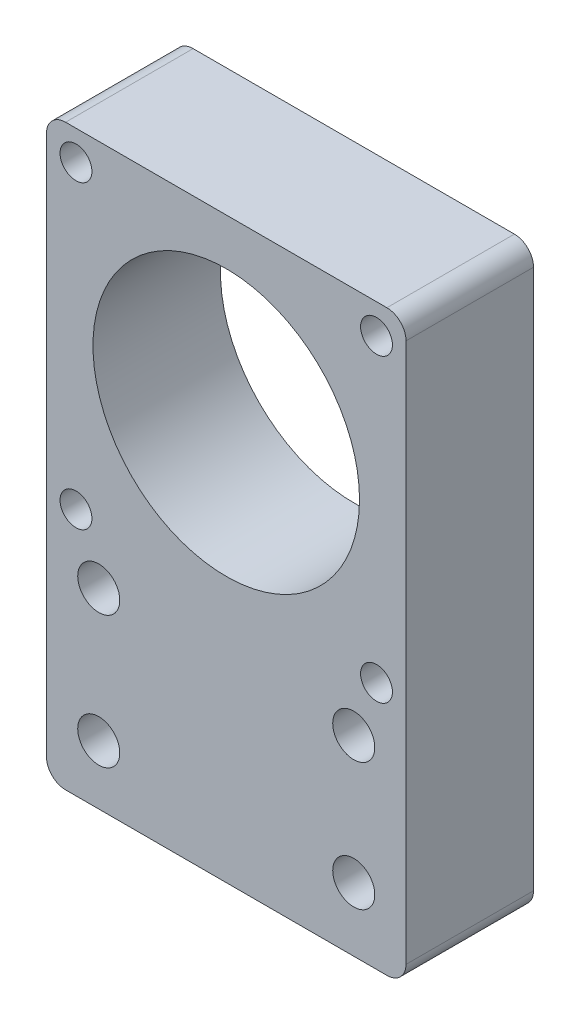
ISO-10303-21;
HEADER;
FILE_DESCRIPTION(('STEP AP214'),'2;1');
FILE_NAME('part.step','',(''),(''),'','','');
FILE_SCHEMA(('AUTOMOTIVE_DESIGN { 1 0 10303 214 1 1 1 1 }'));
ENDSEC;
DATA;
#1=APPLICATION_CONTEXT('core data for automotive mechanical design processes');
#2=APPLICATION_PROTOCOL_DEFINITION('international standard','automotive_design',2000,#1);
#3=PRODUCT_CONTEXT('',#1,'mechanical');
#4=PRODUCT('Part','Part','',(#3));
#5=PRODUCT_RELATED_PRODUCT_CATEGORY('part','',(#4));
#6=PRODUCT_DEFINITION_FORMATION('','',#4);
#7=PRODUCT_DEFINITION_CONTEXT('part definition',#1,'design');
#8=PRODUCT_DEFINITION('design','',#6,#7);
#9=PRODUCT_DEFINITION_SHAPE('','',#8);
#10=(LENGTH_UNIT() NAMED_UNIT(*) SI_UNIT(.MILLI.,.METRE.));
#11=(NAMED_UNIT(*) PLANE_ANGLE_UNIT() SI_UNIT($,.RADIAN.));
#12=(NAMED_UNIT(*) SI_UNIT($,.STERADIAN.) SOLID_ANGLE_UNIT());
#13=UNCERTAINTY_MEASURE_WITH_UNIT(LENGTH_MEASURE(1.E-05),#10,'distance_accuracy_value','');
#14=(GEOMETRIC_REPRESENTATION_CONTEXT(3) GLOBAL_UNCERTAINTY_ASSIGNED_CONTEXT((#13)) GLOBAL_UNIT_ASSIGNED_CONTEXT((#10,
#11,#12)) REPRESENTATION_CONTEXT('',''));
#15=CARTESIAN_POINT('',(0.,0.,0.));
#16=DIRECTION('',(0.,0.,1.));
#17=DIRECTION('',(1.,0.,0.));
#18=AXIS2_PLACEMENT_3D('',#15,#16,#17);
#19=CARTESIAN_POINT('',(-28.2000000001139,53.2000000000001,20.));
#20=DIRECTION('',(0.,-1.,0.));
#21=DIRECTION('',(0.,0.,-1.));
#22=AXIS2_PLACEMENT_3D('',#19,#20,#21);
#23=PLANE('',#22);
#24=DIRECTION('',(-1.,0.,0.));
#25=VECTOR('',#24,1.);
#26=CARTESIAN_POINT('',(-28.2000000001139,53.2000000000001,20.));
#27=LINE('',#26,#25);
#28=CARTESIAN_POINT('',(25.1999999998861,53.2000000000001,20.));
#29=VERTEX_POINT('',#28);
#30=CARTESIAN_POINT('',(-25.2000000001139,53.2000000000001,20.));
#31=VERTEX_POINT('',#30);
#32=EDGE_CURVE('E138',#29,#31,#27,.T.);
#33=ORIENTED_EDGE('',*,*,#32,.F.);
#34=DIRECTION('',(0.,0.,-1.));
#35=VECTOR('',#34,1.);
#36=CARTESIAN_POINT('',(25.1999999998861,53.2000000000001,20.));
#37=LINE('',#36,#35);
#38=CARTESIAN_POINT('',(25.1999999998861,53.2000000000001,0.));
#39=VERTEX_POINT('',#38);
#40=EDGE_CURVE('E13',#29,#39,#37,.T.);
#41=ORIENTED_EDGE('',*,*,#40,.T.);
#42=DIRECTION('',(-1.,0.,0.));
#43=VECTOR('',#42,1.);
#44=CARTESIAN_POINT('',(-28.2000000001139,53.2000000000001,0.));
#45=LINE('',#44,#43);
#46=CARTESIAN_POINT('',(-25.2000000001139,53.2000000000001,0.));
#47=VERTEX_POINT('',#46);
#48=EDGE_CURVE('E143',#39,#47,#45,.T.);
#49=ORIENTED_EDGE('',*,*,#48,.T.);
#50=DIRECTION('',(0.,0.,-1.));
#51=VECTOR('',#50,1.);
#52=CARTESIAN_POINT('',(-25.2000000001139,53.2000000000001,20.));
#53=LINE('',#52,#51);
#54=EDGE_CURVE('E52',#47,#31,#53,.F.);
#55=ORIENTED_EDGE('',*,*,#54,.T.);
#56=EDGE_LOOP('',(#33,#41,#49,#55));
#57=FACE_BOUND('',#56,.T.);
#58=ADVANCED_FACE('F44',(#57),#23,.F.);
#59=CARTESIAN_POINT('',(-28.2000000001139,-3.19999999999987,20.));
#60=DIRECTION('',(1.,0.,0.));
#61=DIRECTION('',(0.,1.,0.));
#62=AXIS2_PLACEMENT_3D('',#59,#60,#61);
#63=PLANE('',#62);
#64=DIRECTION('',(0.,-1.,0.));
#65=VECTOR('',#64,1.);
#66=CARTESIAN_POINT('',(-28.2000000001139,-3.19999999999987,0.));
#67=LINE('',#66,#65);
#68=CARTESIAN_POINT('',(-28.2000000001139,50.2000000000001,0.));
#69=VERTEX_POINT('',#68);
#70=CARTESIAN_POINT('',(-28.2000000001139,-34.4999999999999,0.));
#71=VERTEX_POINT('',#70);
#72=EDGE_CURVE('E139',#69,#71,#67,.T.);
#73=ORIENTED_EDGE('',*,*,#72,.T.);
#74=DIRECTION('',(0.,0.,-1.));
#75=VECTOR('',#74,1.);
#76=CARTESIAN_POINT('',(-28.2000000001139,-34.4999999999999,20.));
#77=LINE('',#76,#75);
#78=CARTESIAN_POINT('',(-28.2000000001139,-34.4999999999999,20.));
#79=VERTEX_POINT('',#78);
#80=EDGE_CURVE('E59',#71,#79,#77,.F.);
#81=ORIENTED_EDGE('',*,*,#80,.T.);
#82=DIRECTION('',(0.,-1.,0.));
#83=VECTOR('',#82,1.);
#84=CARTESIAN_POINT('',(-28.2000000001139,-3.19999999999987,20.));
#85=LINE('',#84,#83);
#86=CARTESIAN_POINT('',(-28.2000000001139,50.2000000000001,20.));
#87=VERTEX_POINT('',#86);
#88=EDGE_CURVE('E141',#87,#79,#85,.T.);
#89=ORIENTED_EDGE('',*,*,#88,.F.);
#90=DIRECTION('',(0.,0.,-1.));
#91=VECTOR('',#90,1.);
#92=CARTESIAN_POINT('',(-28.2000000001139,50.2000000000001,20.));
#93=LINE('',#92,#91);
#94=EDGE_CURVE('E161',#87,#69,#93,.T.);
#95=ORIENTED_EDGE('',*,*,#94,.T.);
#96=EDGE_LOOP('',(#73,#81,#89,#95));
#97=FACE_BOUND('',#96,.T.);
#98=ADVANCED_FACE('F175',(#97),#63,.F.);
#99=CARTESIAN_POINT('',(28.1999999998861,53.2000000000001,20.));
#100=DIRECTION('',(-1.,0.,0.));
#101=DIRECTION('',(0.,-1.,0.));
#102=AXIS2_PLACEMENT_3D('',#99,#100,#101);
#103=PLANE('',#102);
#104=DIRECTION('',(0.,1.,0.));
#105=VECTOR('',#104,1.);
#106=CARTESIAN_POINT('',(28.1999999998861,53.2000000000001,20.));
#107=LINE('',#106,#105);
#108=CARTESIAN_POINT('',(28.1999999998861,-34.4999999999999,20.));
#109=VERTEX_POINT('',#108);
#110=CARTESIAN_POINT('',(28.1999999998861,50.2000000000001,20.));
#111=VERTEX_POINT('',#110);
#112=EDGE_CURVE('E131',#109,#111,#107,.T.);
#113=ORIENTED_EDGE('',*,*,#112,.F.);
#114=DIRECTION('',(0.,0.,-1.));
#115=VECTOR('',#114,1.);
#116=CARTESIAN_POINT('',(28.1999999998861,-34.4999999999999,0.));
#117=LINE('',#116,#115);
#118=CARTESIAN_POINT('',(28.1999999998861,-34.4999999999999,0.));
#119=VERTEX_POINT('',#118);
#120=EDGE_CURVE('E115',#109,#119,#117,.T.);
#121=ORIENTED_EDGE('',*,*,#120,.T.);
#122=DIRECTION('',(0.,1.,0.));
#123=VECTOR('',#122,1.);
#124=CARTESIAN_POINT('',(28.1999999998861,53.2000000000001,0.));
#125=LINE('',#124,#123);
#126=CARTESIAN_POINT('',(28.1999999998861,50.2000000000001,0.));
#127=VERTEX_POINT('',#126);
#128=EDGE_CURVE('E128',#119,#127,#125,.T.);
#129=ORIENTED_EDGE('',*,*,#128,.T.);
#130=DIRECTION('',(0.,0.,-1.));
#131=VECTOR('',#130,1.);
#132=CARTESIAN_POINT('',(28.1999999998861,50.2000000000001,20.));
#133=LINE('',#132,#131);
#134=EDGE_CURVE('E133',#127,#111,#133,.F.);
#135=ORIENTED_EDGE('',*,*,#134,.T.);
#136=EDGE_LOOP('',(#113,#121,#129,#135));
#137=FACE_BOUND('',#136,.T.);
#138=ADVANCED_FACE('F127',(#137),#103,.F.);
#139=CARTESIAN_POINT('',(0.,0.,20.));
#140=DIRECTION('',(0.,0.,-1.));
#141=DIRECTION('',(-1.,0.,0.));
#142=AXIS2_PLACEMENT_3D('',#139,#140,#141);
#143=PLANE('',#142);
#144=CARTESIAN_POINT('',(19.9999999998865,-7.49999999999986,20.));
#145=DIRECTION('',(0.,0.,-1.));
#146=DIRECTION('',(-1.,0.,0.));
#147=AXIS2_PLACEMENT_3D('',#144,#145,#146);
#148=CIRCLE('',#147,3.29999999999999);
#149=CARTESIAN_POINT('',(16.6999999998865,-7.49999999999986,20.));
#150=VERTEX_POINT('',#149);
#151=EDGE_CURVE('E395',#150,#150,#148,.T.);
#152=ORIENTED_EDGE('',*,*,#151,.T.);
#153=EDGE_LOOP('',(#152));
#154=FACE_BOUND('',#153,.T.);
#155=CARTESIAN_POINT('',(19.9999999998865,-27.4999999999999,20.));
#156=DIRECTION('',(0.,0.,-1.));
#157=DIRECTION('',(-1.,0.,0.));
#158=AXIS2_PLACEMENT_3D('',#155,#156,#157);
#159=CIRCLE('',#158,3.29999999999999);
#160=CARTESIAN_POINT('',(16.6999999998865,-27.4999999999999,20.));
#161=VERTEX_POINT('',#160);
#162=EDGE_CURVE('E389',#161,#161,#159,.T.);
#163=ORIENTED_EDGE('',*,*,#162,.T.);
#164=EDGE_LOOP('',(#163));
#165=FACE_BOUND('',#164,.T.);
#166=CARTESIAN_POINT('',(-20.0000000001135,-28.2376577347049,20.));
#167=DIRECTION('',(0.,0.,-1.));
#168=DIRECTION('',(-1.,0.,0.));
#169=AXIS2_PLACEMENT_3D('',#166,#167,#168);
#170=CIRCLE('',#169,3.29999999999999);
#171=CARTESIAN_POINT('',(-23.3000000001135,-28.2376577347049,20.));
#172=VERTEX_POINT('',#171);
#173=EDGE_CURVE('E383',#172,#172,#170,.T.);
#174=ORIENTED_EDGE('',*,*,#173,.T.);
#175=EDGE_LOOP('',(#174));
#176=FACE_BOUND('',#175,.T.);
#177=CARTESIAN_POINT('',(-20.0000000001135,-7.49999999999986,20.));
#178=DIRECTION('',(0.,0.,-1.));
#179=DIRECTION('',(-1.,0.,0.));
#180=AXIS2_PLACEMENT_3D('',#177,#178,#179);
#181=CIRCLE('',#180,3.29999999999999);
#182=CARTESIAN_POINT('',(-23.3000000001135,-7.49999999999986,20.));
#183=VERTEX_POINT('',#182);
#184=EDGE_CURVE('E377',#183,#183,#181,.T.);
#185=ORIENTED_EDGE('',*,*,#184,.T.);
#186=EDGE_LOOP('',(#185));
#187=FACE_BOUND('',#186,.T.);
#188=CARTESIAN_POINT('',(23.5699999998861,48.5700000000001,20.));
#189=DIRECTION('',(0.,0.,-1.));
#190=DIRECTION('',(-1.,0.,0.));
#191=AXIS2_PLACEMENT_3D('',#188,#189,#190);
#192=CIRCLE('',#191,2.5);
#193=CARTESIAN_POINT('',(21.0699999998861,48.5700000000001,20.));
#194=VERTEX_POINT('',#193);
#195=EDGE_CURVE('E371',#194,#194,#192,.T.);
#196=ORIENTED_EDGE('',*,*,#195,.T.);
#197=EDGE_LOOP('',(#196));
#198=FACE_BOUND('',#197,.T.);
#199=CARTESIAN_POINT('',(-23.5700000001139,48.5700000000001,20.));
#200=DIRECTION('',(0.,0.,-1.));
#201=DIRECTION('',(-1.,0.,0.));
#202=AXIS2_PLACEMENT_3D('',#199,#200,#201);
#203=CIRCLE('',#202,2.5);
#204=CARTESIAN_POINT('',(-26.0700000001139,48.5700000000001,20.));
#205=VERTEX_POINT('',#204);
#206=EDGE_CURVE('E349',#205,#205,#203,.T.);
#207=ORIENTED_EDGE('',*,*,#206,.T.);
#208=EDGE_LOOP('',(#207));
#209=FACE_BOUND('',#208,.T.);
#210=CARTESIAN_POINT('',(23.5699999998861,1.43000000000014,20.));
#211=DIRECTION('',(0.,0.,-1.));
#212=DIRECTION('',(-1.,0.,0.));
#213=AXIS2_PLACEMENT_3D('',#210,#211,#212);
#214=CIRCLE('',#213,2.5);
#215=CARTESIAN_POINT('',(21.0699999998861,1.43000000000014,20.));
#216=VERTEX_POINT('',#215);
#217=EDGE_CURVE('E344',#216,#216,#214,.T.);
#218=ORIENTED_EDGE('',*,*,#217,.T.);
#219=EDGE_LOOP('',(#218));
#220=FACE_BOUND('',#219,.T.);
#221=CARTESIAN_POINT('',(-23.5700000001139,1.43000000000014,20.));
#222=DIRECTION('',(0.,0.,-1.));
#223=DIRECTION('',(-1.,0.,0.));
#224=AXIS2_PLACEMENT_3D('',#221,#222,#223);
#225=CIRCLE('',#224,2.5);
#226=CARTESIAN_POINT('',(-26.0700000001139,1.43000000000014,20.));
#227=VERTEX_POINT('',#226);
#228=EDGE_CURVE('E190',#227,#227,#225,.T.);
#229=ORIENTED_EDGE('',*,*,#228,.T.);
#230=EDGE_LOOP('',(#229));
#231=FACE_BOUND('',#230,.T.);
#232=CARTESIAN_POINT('',(-1.13805060393229E-10,25.0000000000021,20.));
#233=DIRECTION('',(0.,0.,1.));
#234=DIRECTION('',(1.,0.,0.));
#235=AXIS2_PLACEMENT_3D('',#232,#233,#234);
#236=CIRCLE('',#235,20.9043555487387);
#237=CARTESIAN_POINT('',(20.9043555486249,25.0000000000021,20.));
#238=VERTEX_POINT('',#237);
#239=EDGE_CURVE('E185',#238,#238,#236,.T.);
#240=ORIENTED_EDGE('',*,*,#239,.F.);
#241=EDGE_LOOP('',(#240));
#242=FACE_BOUND('',#241,.T.);
#243=DIRECTION('',(-1.,0.,0.));
#244=VECTOR('',#243,1.);
#245=CARTESIAN_POINT('',(28.1999999998861,-37.4999999999999,20.));
#246=LINE('',#245,#244);
#247=CARTESIAN_POINT('',(25.1999999998861,-37.4999999999999,20.));
#248=VERTEX_POINT('',#247);
#249=CARTESIAN_POINT('',(-25.2000000001139,-37.4999999999999,20.));
#250=VERTEX_POINT('',#249);
#251=EDGE_CURVE('E184',#248,#250,#246,.T.);
#252=ORIENTED_EDGE('',*,*,#251,.F.);
#253=CARTESIAN_POINT('',(25.1999999998861,-34.4999999999999,20.));
#254=DIRECTION('',(0.,0.,-1.));
#255=DIRECTION('',(-1.,0.,0.));
#256=AXIS2_PLACEMENT_3D('',#253,#254,#255);
#257=CIRCLE('',#256,3.);
#258=EDGE_CURVE('E159',#248,#109,#257,.F.);
#259=ORIENTED_EDGE('',*,*,#258,.T.);
#260=ORIENTED_EDGE('',*,*,#112,.T.);
#261=CARTESIAN_POINT('',(25.1999999998861,50.2000000000001,20.));
#262=DIRECTION('',(0.,0.,-1.));
#263=DIRECTION('',(-1.,0.,0.));
#264=AXIS2_PLACEMENT_3D('',#261,#262,#263);
#265=CIRCLE('',#264,3.);
#266=EDGE_CURVE('E155',#111,#29,#265,.F.);
#267=ORIENTED_EDGE('',*,*,#266,.T.);
#268=ORIENTED_EDGE('',*,*,#32,.T.);
#269=CARTESIAN_POINT('',(-25.2000000001139,50.2000000000001,20.));
#270=DIRECTION('',(0.,0.,-1.));
#271=DIRECTION('',(-1.,0.,0.));
#272=AXIS2_PLACEMENT_3D('',#269,#270,#271);
#273=CIRCLE('',#272,3.);
#274=EDGE_CURVE('E66',#31,#87,#273,.F.);
#275=ORIENTED_EDGE('',*,*,#274,.T.);
#276=ORIENTED_EDGE('',*,*,#88,.T.);
#277=CARTESIAN_POINT('',(-25.2000000001139,-34.4999999999999,20.));
#278=DIRECTION('',(0.,0.,-1.));
#279=DIRECTION('',(-1.,0.,0.));
#280=AXIS2_PLACEMENT_3D('',#277,#278,#279);
#281=CIRCLE('',#280,3.);
#282=EDGE_CURVE('E157',#79,#250,#281,.F.);
#283=ORIENTED_EDGE('',*,*,#282,.T.);
#284=EDGE_LOOP('',(#252,#259,#260,#267,#268,#275,#276,#283));
#285=FACE_BOUND('',#284,.T.);
#286=ADVANCED_FACE('F171',(#154,#165,#176,#187,#198,#209,#220,#231,#242,#285),#143,.F.);
#287=CARTESIAN_POINT('',(0.,0.,0.));
#288=DIRECTION('',(0.,0.,-1.));
#289=DIRECTION('',(-1.,0.,0.));
#290=AXIS2_PLACEMENT_3D('',#287,#288,#289);
#291=PLANE('',#290);
#292=CARTESIAN_POINT('',(19.9999999998865,-7.49999999999986,0.));
#293=DIRECTION('',(0.,0.,-1.));
#294=DIRECTION('',(-1.,0.,0.));
#295=AXIS2_PLACEMENT_3D('',#292,#293,#294);
#296=CIRCLE('',#295,3.3);
#297=CARTESIAN_POINT('',(16.6999999998865,-7.49999999999986,0.));
#298=VERTEX_POINT('',#297);
#299=EDGE_CURVE('E398',#298,#298,#296,.T.);
#300=ORIENTED_EDGE('',*,*,#299,.F.);
#301=EDGE_LOOP('',(#300));
#302=FACE_BOUND('',#301,.T.);
#303=CARTESIAN_POINT('',(19.9999999998865,-27.4999999999999,0.));
#304=DIRECTION('',(0.,0.,-1.));
#305=DIRECTION('',(-1.,0.,0.));
#306=AXIS2_PLACEMENT_3D('',#303,#304,#305);
#307=CIRCLE('',#306,3.3);
#308=CARTESIAN_POINT('',(16.6999999998865,-27.4999999999999,0.));
#309=VERTEX_POINT('',#308);
#310=EDGE_CURVE('E392',#309,#309,#307,.T.);
#311=ORIENTED_EDGE('',*,*,#310,.F.);
#312=EDGE_LOOP('',(#311));
#313=FACE_BOUND('',#312,.T.);
#314=CARTESIAN_POINT('',(-20.0000000001135,-28.2376577347049,0.));
#315=DIRECTION('',(0.,0.,-1.));
#316=DIRECTION('',(-1.,0.,0.));
#317=AXIS2_PLACEMENT_3D('',#314,#315,#316);
#318=CIRCLE('',#317,3.3);
#319=CARTESIAN_POINT('',(-23.3000000001135,-28.2376577347049,0.));
#320=VERTEX_POINT('',#319);
#321=EDGE_CURVE('E386',#320,#320,#318,.T.);
#322=ORIENTED_EDGE('',*,*,#321,.F.);
#323=EDGE_LOOP('',(#322));
#324=FACE_BOUND('',#323,.T.);
#325=CARTESIAN_POINT('',(-20.0000000001135,-7.49999999999986,0.));
#326=DIRECTION('',(0.,0.,-1.));
#327=DIRECTION('',(-1.,0.,0.));
#328=AXIS2_PLACEMENT_3D('',#325,#326,#327);
#329=CIRCLE('',#328,3.3);
#330=CARTESIAN_POINT('',(-23.3000000001135,-7.49999999999986,0.));
#331=VERTEX_POINT('',#330);
#332=EDGE_CURVE('E380',#331,#331,#329,.T.);
#333=ORIENTED_EDGE('',*,*,#332,.F.);
#334=EDGE_LOOP('',(#333));
#335=FACE_BOUND('',#334,.T.);
#336=CARTESIAN_POINT('',(23.5699999998861,48.5700000000001,0.));
#337=DIRECTION('',(0.,0.,-1.));
#338=DIRECTION('',(-1.,0.,0.));
#339=AXIS2_PLACEMENT_3D('',#336,#337,#338);
#340=CIRCLE('',#339,2.49999999999999);
#341=CARTESIAN_POINT('',(21.0699999998861,48.5700000000001,0.));
#342=VERTEX_POINT('',#341);
#343=EDGE_CURVE('E374',#342,#342,#340,.T.);
#344=ORIENTED_EDGE('',*,*,#343,.F.);
#345=EDGE_LOOP('',(#344));
#346=FACE_BOUND('',#345,.T.);
#347=CARTESIAN_POINT('',(-23.5700000001139,48.5700000000001,0.));
#348=DIRECTION('',(0.,0.,-1.));
#349=DIRECTION('',(-1.,0.,0.));
#350=AXIS2_PLACEMENT_3D('',#347,#348,#349);
#351=CIRCLE('',#350,2.49999999999999);
#352=CARTESIAN_POINT('',(-26.0700000001139,48.5700000000001,0.));
#353=VERTEX_POINT('',#352);
#354=EDGE_CURVE('E354',#353,#353,#351,.T.);
#355=ORIENTED_EDGE('',*,*,#354,.F.);
#356=EDGE_LOOP('',(#355));
#357=FACE_BOUND('',#356,.T.);
#358=CARTESIAN_POINT('',(23.5699999998861,1.43000000000014,0.));
#359=DIRECTION('',(0.,0.,-1.));
#360=DIRECTION('',(-1.,0.,0.));
#361=AXIS2_PLACEMENT_3D('',#358,#359,#360);
#362=CIRCLE('',#361,2.49999999999999);
#363=CARTESIAN_POINT('',(21.0699999998861,1.43000000000014,0.));
#364=VERTEX_POINT('',#363);
#365=EDGE_CURVE('E347',#364,#364,#362,.T.);
#366=ORIENTED_EDGE('',*,*,#365,.F.);
#367=EDGE_LOOP('',(#366));
#368=FACE_BOUND('',#367,.T.);
#369=CARTESIAN_POINT('',(-23.5700000001139,1.43000000000014,0.));
#370=DIRECTION('',(0.,0.,-1.));
#371=DIRECTION('',(-1.,0.,0.));
#372=AXIS2_PLACEMENT_3D('',#369,#370,#371);
#373=CIRCLE('',#372,2.49999999999999);
#374=CARTESIAN_POINT('',(-26.0700000001139,1.43000000000014,0.));
#375=VERTEX_POINT('',#374);
#376=EDGE_CURVE('E351',#375,#375,#373,.T.);
#377=ORIENTED_EDGE('',*,*,#376,.F.);
#378=EDGE_LOOP('',(#377));
#379=FACE_BOUND('',#378,.T.);
#380=CARTESIAN_POINT('',(-1.13805060393229E-10,25.0000000000021,0.));
#381=DIRECTION('',(0.,0.,1.));
#382=DIRECTION('',(1.,0.,0.));
#383=AXIS2_PLACEMENT_3D('',#380,#381,#382);
#384=CIRCLE('',#383,20.9043555487387);
#385=CARTESIAN_POINT('',(20.9043555486249,25.0000000000021,0.));
#386=VERTEX_POINT('',#385);
#387=EDGE_CURVE('E188',#386,#386,#384,.T.);
#388=ORIENTED_EDGE('',*,*,#387,.T.);
#389=EDGE_LOOP('',(#388));
#390=FACE_BOUND('',#389,.T.);
#391=ORIENTED_EDGE('',*,*,#128,.F.);
#392=CARTESIAN_POINT('',(25.1999999998861,-34.4999999999999,0.));
#393=DIRECTION('',(0.,0.,-1.));
#394=DIRECTION('',(-1.,0.,0.));
#395=AXIS2_PLACEMENT_3D('',#392,#393,#394);
#396=CIRCLE('',#395,3.);
#397=CARTESIAN_POINT('',(25.1999999998861,-37.4999999999999,0.));
#398=VERTEX_POINT('',#397);
#399=EDGE_CURVE('E111',#119,#398,#396,.T.);
#400=ORIENTED_EDGE('',*,*,#399,.T.);
#401=DIRECTION('',(-1.,0.,0.));
#402=VECTOR('',#401,1.);
#403=CARTESIAN_POINT('',(28.1999999998861,-37.4999999999999,0.));
#404=LINE('',#403,#402);
#405=CARTESIAN_POINT('',(-25.2000000001139,-37.4999999999999,0.));
#406=VERTEX_POINT('',#405);
#407=EDGE_CURVE('E176',#398,#406,#404,.T.);
#408=ORIENTED_EDGE('',*,*,#407,.T.);
#409=CARTESIAN_POINT('',(-25.2000000001139,-34.4999999999999,0.));
#410=DIRECTION('',(0.,0.,-1.));
#411=DIRECTION('',(-1.,0.,0.));
#412=AXIS2_PLACEMENT_3D('',#409,#410,#411);
#413=CIRCLE('',#412,3.);
#414=EDGE_CURVE('E122',#406,#71,#413,.T.);
#415=ORIENTED_EDGE('',*,*,#414,.T.);
#416=ORIENTED_EDGE('',*,*,#72,.F.);
#417=CARTESIAN_POINT('',(-25.2000000001139,50.2000000000001,0.));
#418=DIRECTION('',(0.,0.,-1.));
#419=DIRECTION('',(-1.,0.,0.));
#420=AXIS2_PLACEMENT_3D('',#417,#418,#419);
#421=CIRCLE('',#420,3.);
#422=EDGE_CURVE('E132',#69,#47,#421,.T.);
#423=ORIENTED_EDGE('',*,*,#422,.T.);
#424=ORIENTED_EDGE('',*,*,#48,.F.);
#425=CARTESIAN_POINT('',(25.1999999998861,50.2000000000001,0.));
#426=DIRECTION('',(0.,0.,-1.));
#427=DIRECTION('',(-1.,0.,0.));
#428=AXIS2_PLACEMENT_3D('',#425,#426,#427);
#429=CIRCLE('',#428,3.);
#430=EDGE_CURVE('E137',#39,#127,#429,.T.);
#431=ORIENTED_EDGE('',*,*,#430,.T.);
#432=EDGE_LOOP('',(#391,#400,#408,#415,#416,#423,#424,#431));
#433=FACE_BOUND('',#432,.T.);
#434=ADVANCED_FACE('F135',(#302,#313,#324,#335,#346,#357,#368,#379,#390,#433),#291,.T.);
#435=CARTESIAN_POINT('',(-1.13805060393229E-10,25.0000000000021,0.));
#436=DIRECTION('',(0.,0.,1.));
#437=DIRECTION('',(1.,0.,0.));
#438=AXIS2_PLACEMENT_3D('',#435,#436,#437);
#439=CYLINDRICAL_SURFACE('',#438,20.9043555487387);
#440=ORIENTED_EDGE('',*,*,#387,.F.);
#441=EDGE_LOOP('',(#440));
#442=FACE_BOUND('',#441,.T.);
#443=ORIENTED_EDGE('',*,*,#239,.T.);
#444=EDGE_LOOP('',(#443));
#445=FACE_BOUND('',#444,.T.);
#446=ADVANCED_FACE('F219',(#442,#445),#439,.F.);
#447=CARTESIAN_POINT('',(28.1999999998861,-37.4999999999999,20.));
#448=DIRECTION('',(0.,-1.,0.));
#449=DIRECTION('',(0.,0.,-1.));
#450=AXIS2_PLACEMENT_3D('',#447,#448,#449);
#451=PLANE('',#450);
#452=ORIENTED_EDGE('',*,*,#407,.F.);
#453=DIRECTION('',(0.,0.,-1.));
#454=VECTOR('',#453,1.);
#455=CARTESIAN_POINT('',(25.1999999998861,-37.4999999999999,20.));
#456=LINE('',#455,#454);
#457=EDGE_CURVE('E116',#398,#248,#456,.F.);
#458=ORIENTED_EDGE('',*,*,#457,.T.);
#459=ORIENTED_EDGE('',*,*,#251,.T.);
#460=DIRECTION('',(0.,0.,-1.));
#461=VECTOR('',#460,1.);
#462=CARTESIAN_POINT('',(-25.2000000001139,-37.4999999999999,0.));
#463=LINE('',#462,#461);
#464=EDGE_CURVE('E121',#250,#406,#463,.T.);
#465=ORIENTED_EDGE('',*,*,#464,.T.);
#466=EDGE_LOOP('',(#452,#458,#459,#465));
#467=FACE_BOUND('',#466,.T.);
#468=ADVANCED_FACE('F183',(#467),#451,.T.);
#469=CARTESIAN_POINT('',(25.1999999998861,-34.4999999999999,20.));
#470=DIRECTION('',(0.,0.,1.));
#471=DIRECTION('',(1.,0.,0.));
#472=AXIS2_PLACEMENT_3D('',#469,#470,#471);
#473=CYLINDRICAL_SURFACE('',#472,3.);
#474=ORIENTED_EDGE('',*,*,#258,.F.);
#475=ORIENTED_EDGE('',*,*,#457,.F.);
#476=ORIENTED_EDGE('',*,*,#399,.F.);
#477=ORIENTED_EDGE('',*,*,#120,.F.);
#478=EDGE_LOOP('',(#474,#475,#476,#477));
#479=FACE_BOUND('',#478,.T.);
#480=ADVANCED_FACE('F114',(#479),#473,.T.);
#481=CARTESIAN_POINT('',(-25.2000000001139,-34.4999999999999,20.));
#482=DIRECTION('',(0.,0.,1.));
#483=DIRECTION('',(1.,0.,0.));
#484=AXIS2_PLACEMENT_3D('',#481,#482,#483);
#485=CYLINDRICAL_SURFACE('',#484,3.);
#486=ORIENTED_EDGE('',*,*,#282,.F.);
#487=ORIENTED_EDGE('',*,*,#80,.F.);
#488=ORIENTED_EDGE('',*,*,#414,.F.);
#489=ORIENTED_EDGE('',*,*,#464,.F.);
#490=EDGE_LOOP('',(#486,#487,#488,#489));
#491=FACE_BOUND('',#490,.T.);
#492=ADVANCED_FACE('F180',(#491),#485,.T.);
#493=CARTESIAN_POINT('',(25.1999999998861,50.2000000000001,20.));
#494=DIRECTION('',(0.,0.,-1.));
#495=DIRECTION('',(-1.,0.,0.));
#496=AXIS2_PLACEMENT_3D('',#493,#494,#495);
#497=CYLINDRICAL_SURFACE('',#496,3.);
#498=ORIENTED_EDGE('',*,*,#266,.F.);
#499=ORIENTED_EDGE('',*,*,#134,.F.);
#500=ORIENTED_EDGE('',*,*,#430,.F.);
#501=ORIENTED_EDGE('',*,*,#40,.F.);
#502=EDGE_LOOP('',(#498,#499,#500,#501));
#503=FACE_BOUND('',#502,.T.);
#504=ADVANCED_FACE('F199',(#503),#497,.T.);
#505=CARTESIAN_POINT('',(-25.2000000001139,50.2000000000001,20.));
#506=DIRECTION('',(0.,0.,-1.));
#507=DIRECTION('',(-1.,0.,0.));
#508=AXIS2_PLACEMENT_3D('',#505,#506,#507);
#509=CYLINDRICAL_SURFACE('',#508,3.);
#510=ORIENTED_EDGE('',*,*,#274,.F.);
#511=ORIENTED_EDGE('',*,*,#54,.F.);
#512=ORIENTED_EDGE('',*,*,#422,.F.);
#513=ORIENTED_EDGE('',*,*,#94,.F.);
#514=EDGE_LOOP('',(#510,#511,#512,#513));
#515=FACE_BOUND('',#514,.T.);
#516=ADVANCED_FACE('F46',(#515),#509,.T.);
#517=CARTESIAN_POINT('',(-23.5700000001139,1.43000000000014,0.));
#518=DIRECTION('',(0.,0.,-1.));
#519=DIRECTION('',(-1.,0.,0.));
#520=AXIS2_PLACEMENT_3D('',#517,#518,#519);
#521=CYLINDRICAL_SURFACE('',#520,2.49999999999999);
#522=ORIENTED_EDGE('',*,*,#228,.F.);
#523=EDGE_LOOP('',(#522));
#524=FACE_BOUND('',#523,.T.);
#525=ORIENTED_EDGE('',*,*,#376,.T.);
#526=EDGE_LOOP('',(#525));
#527=FACE_BOUND('',#526,.T.);
#528=ADVANCED_FACE('F205',(#524,#527),#521,.F.);
#529=CARTESIAN_POINT('',(23.5699999998861,1.43000000000014,0.));
#530=DIRECTION('',(0.,0.,-1.));
#531=DIRECTION('',(-1.,0.,0.));
#532=AXIS2_PLACEMENT_3D('',#529,#530,#531);
#533=CYLINDRICAL_SURFACE('',#532,2.49999999999999);
#534=ORIENTED_EDGE('',*,*,#217,.F.);
#535=EDGE_LOOP('',(#534));
#536=FACE_BOUND('',#535,.T.);
#537=ORIENTED_EDGE('',*,*,#365,.T.);
#538=EDGE_LOOP('',(#537));
#539=FACE_BOUND('',#538,.T.);
#540=ADVANCED_FACE('F333',(#536,#539),#533,.F.);
#541=CARTESIAN_POINT('',(-23.5700000001139,48.5700000000001,0.));
#542=DIRECTION('',(0.,0.,-1.));
#543=DIRECTION('',(-1.,0.,0.));
#544=AXIS2_PLACEMENT_3D('',#541,#542,#543);
#545=CYLINDRICAL_SURFACE('',#544,2.49999999999999);
#546=ORIENTED_EDGE('',*,*,#206,.F.);
#547=EDGE_LOOP('',(#546));
#548=FACE_BOUND('',#547,.T.);
#549=ORIENTED_EDGE('',*,*,#354,.T.);
#550=EDGE_LOOP('',(#549));
#551=FACE_BOUND('',#550,.T.);
#552=ADVANCED_FACE('F330',(#548,#551),#545,.F.);
#553=CARTESIAN_POINT('',(23.5699999998861,48.5700000000001,0.));
#554=DIRECTION('',(0.,0.,-1.));
#555=DIRECTION('',(-1.,0.,0.));
#556=AXIS2_PLACEMENT_3D('',#553,#554,#555);
#557=CYLINDRICAL_SURFACE('',#556,2.49999999999999);
#558=ORIENTED_EDGE('',*,*,#195,.F.);
#559=EDGE_LOOP('',(#558));
#560=FACE_BOUND('',#559,.T.);
#561=ORIENTED_EDGE('',*,*,#343,.T.);
#562=EDGE_LOOP('',(#561));
#563=FACE_BOUND('',#562,.T.);
#564=ADVANCED_FACE('F290',(#560,#563),#557,.F.);
#565=CARTESIAN_POINT('',(-20.0000000001135,-7.49999999999986,0.));
#566=DIRECTION('',(0.,0.,-1.));
#567=DIRECTION('',(-1.,0.,0.));
#568=AXIS2_PLACEMENT_3D('',#565,#566,#567);
#569=CYLINDRICAL_SURFACE('',#568,3.3);
#570=ORIENTED_EDGE('',*,*,#184,.F.);
#571=EDGE_LOOP('',(#570));
#572=FACE_BOUND('',#571,.T.);
#573=ORIENTED_EDGE('',*,*,#332,.T.);
#574=EDGE_LOOP('',(#573));
#575=FACE_BOUND('',#574,.T.);
#576=ADVANCED_FACE('F284',(#572,#575),#569,.F.);
#577=CARTESIAN_POINT('',(-20.0000000001135,-28.2376577347049,0.));
#578=DIRECTION('',(0.,0.,-1.));
#579=DIRECTION('',(-1.,0.,0.));
#580=AXIS2_PLACEMENT_3D('',#577,#578,#579);
#581=CYLINDRICAL_SURFACE('',#580,3.3);
#582=ORIENTED_EDGE('',*,*,#173,.F.);
#583=EDGE_LOOP('',(#582));
#584=FACE_BOUND('',#583,.T.);
#585=ORIENTED_EDGE('',*,*,#321,.T.);
#586=EDGE_LOOP('',(#585));
#587=FACE_BOUND('',#586,.T.);
#588=ADVANCED_FACE('F289',(#584,#587),#581,.F.);
#589=CARTESIAN_POINT('',(19.9999999998865,-27.4999999999999,0.));
#590=DIRECTION('',(0.,0.,-1.));
#591=DIRECTION('',(-1.,0.,0.));
#592=AXIS2_PLACEMENT_3D('',#589,#590,#591);
#593=CYLINDRICAL_SURFACE('',#592,3.3);
#594=ORIENTED_EDGE('',*,*,#162,.F.);
#595=EDGE_LOOP('',(#594));
#596=FACE_BOUND('',#595,.T.);
#597=ORIENTED_EDGE('',*,*,#310,.T.);
#598=EDGE_LOOP('',(#597));
#599=FACE_BOUND('',#598,.T.);
#600=ADVANCED_FACE('F302',(#596,#599),#593,.F.);
#601=CARTESIAN_POINT('',(19.9999999998865,-7.49999999999986,0.));
#602=DIRECTION('',(0.,0.,-1.));
#603=DIRECTION('',(-1.,0.,0.));
#604=AXIS2_PLACEMENT_3D('',#601,#602,#603);
#605=CYLINDRICAL_SURFACE('',#604,3.3);
#606=ORIENTED_EDGE('',*,*,#151,.F.);
#607=EDGE_LOOP('',(#606));
#608=FACE_BOUND('',#607,.T.);
#609=ORIENTED_EDGE('',*,*,#299,.T.);
#610=EDGE_LOOP('',(#609));
#611=FACE_BOUND('',#610,.T.);
#612=ADVANCED_FACE('F312',(#608,#611),#605,.F.);
#613=CLOSED_SHELL('',(#58,#98,#138,#286,#434,#446,#468,#480,#492,#504,#516,#528,#540,#552,#564,
#576,#588,#600,#612));
#614=MANIFOLD_SOLID_BREP('B2',#613);
#615=ADVANCED_BREP_SHAPE_REPRESENTATION('',(#18,#614),#14);
#616=SHAPE_DEFINITION_REPRESENTATION(#9,#615);
ENDSEC;
END-ISO-10303-21;
